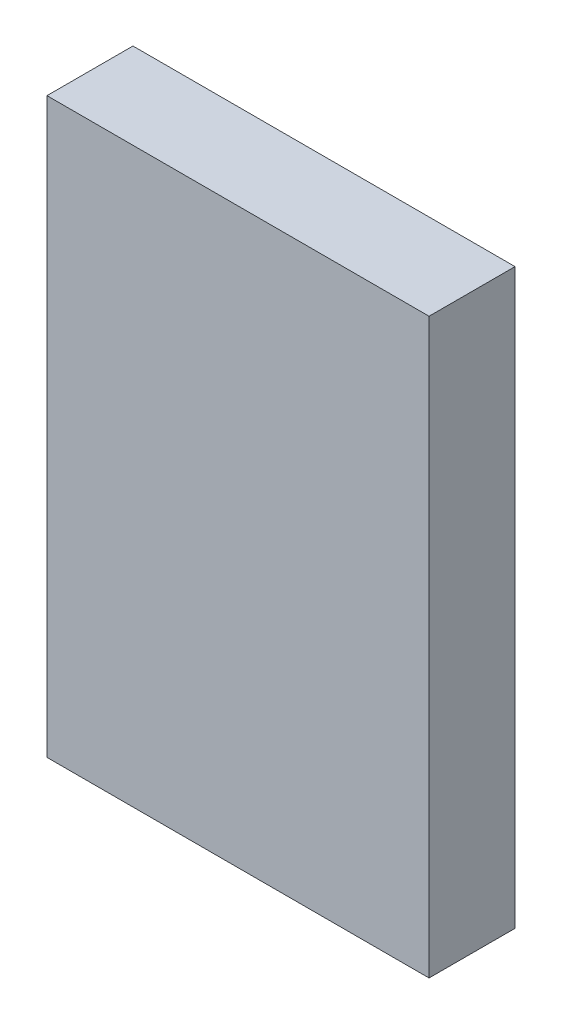
ISO-10303-21;
HEADER;
FILE_DESCRIPTION(('STEP AP214'),'2;1');
FILE_NAME('part.step','',(''),(''),'','','');
FILE_SCHEMA(('AUTOMOTIVE_DESIGN { 1 0 10303 214 1 1 1 1 }'));
ENDSEC;
DATA;
#1=APPLICATION_CONTEXT('core data for automotive mechanical design processes');
#2=APPLICATION_PROTOCOL_DEFINITION('international standard','automotive_design',2000,#1);
#3=PRODUCT_CONTEXT('',#1,'mechanical');
#4=PRODUCT('Part','Part','',(#3));
#5=PRODUCT_RELATED_PRODUCT_CATEGORY('part','',(#4));
#6=PRODUCT_DEFINITION_FORMATION('','',#4);
#7=PRODUCT_DEFINITION_CONTEXT('part definition',#1,'design');
#8=PRODUCT_DEFINITION('design','',#6,#7);
#9=PRODUCT_DEFINITION_SHAPE('','',#8);
#10=(LENGTH_UNIT() NAMED_UNIT(*) SI_UNIT(.MILLI.,.METRE.));
#11=(NAMED_UNIT(*) PLANE_ANGLE_UNIT() SI_UNIT($,.RADIAN.));
#12=(NAMED_UNIT(*) SI_UNIT($,.STERADIAN.) SOLID_ANGLE_UNIT());
#13=UNCERTAINTY_MEASURE_WITH_UNIT(LENGTH_MEASURE(1.E-05),#10,'distance_accuracy_value','');
#14=(GEOMETRIC_REPRESENTATION_CONTEXT(3) GLOBAL_UNCERTAINTY_ASSIGNED_CONTEXT((#13)) GLOBAL_UNIT_ASSIGNED_CONTEXT((#10,
#11,#12)) REPRESENTATION_CONTEXT('',''));
#15=CARTESIAN_POINT('',(0.,0.,0.));
#16=DIRECTION('',(0.,0.,1.));
#17=DIRECTION('',(1.,0.,0.));
#18=AXIS2_PLACEMENT_3D('',#15,#16,#17);
#19=CARTESIAN_POINT('',(40.,60.,18.));
#20=DIRECTION('',(-1.,0.,0.));
#21=DIRECTION('',(0.,0.,1.));
#22=AXIS2_PLACEMENT_3D('',#19,#20,#21);
#23=PLANE('',#22);
#24=DIRECTION('',(0.,1.,0.));
#25=VECTOR('',#24,1.);
#26=CARTESIAN_POINT('',(40.,60.,0.));
#27=LINE('',#26,#25);
#28=CARTESIAN_POINT('',(40.,-60.,0.));
#29=VERTEX_POINT('',#28);
#30=CARTESIAN_POINT('',(40.,60.,0.));
#31=VERTEX_POINT('',#30);
#32=EDGE_CURVE('E96',#29,#31,#27,.T.);
#33=ORIENTED_EDGE('',*,*,#32,.T.);
#34=DIRECTION('',(0.,0.,-1.));
#35=VECTOR('',#34,1.);
#36=CARTESIAN_POINT('',(40.,60.,18.));
#37=LINE('',#36,#35);
#38=CARTESIAN_POINT('',(40.,60.,18.));
#39=VERTEX_POINT('',#38);
#40=EDGE_CURVE('E11',#39,#31,#37,.T.);
#41=ORIENTED_EDGE('',*,*,#40,.F.);
#42=DIRECTION('',(0.,1.,0.));
#43=VECTOR('',#42,1.);
#44=CARTESIAN_POINT('',(40.,60.,18.));
#45=LINE('',#44,#43);
#46=CARTESIAN_POINT('',(40.,-60.,18.));
#47=VERTEX_POINT('',#46);
#48=EDGE_CURVE('E84',#47,#39,#45,.T.);
#49=ORIENTED_EDGE('',*,*,#48,.F.);
#50=DIRECTION('',(0.,0.,-1.));
#51=VECTOR('',#50,1.);
#52=CARTESIAN_POINT('',(40.,-60.,18.));
#53=LINE('',#52,#51);
#54=EDGE_CURVE('E92',#47,#29,#53,.T.);
#55=ORIENTED_EDGE('',*,*,#54,.T.);
#56=EDGE_LOOP('',(#33,#41,#49,#55));
#57=FACE_BOUND('',#56,.T.);
#58=ADVANCED_FACE('F33',(#57),#23,.F.);
#59=CARTESIAN_POINT('',(-40.,60.,18.));
#60=DIRECTION('',(0.,-1.,0.));
#61=DIRECTION('',(0.,0.,-1.));
#62=AXIS2_PLACEMENT_3D('',#59,#60,#61);
#63=PLANE('',#62);
#64=DIRECTION('',(-1.,0.,0.));
#65=VECTOR('',#64,1.);
#66=CARTESIAN_POINT('',(-40.,60.,0.));
#67=LINE('',#66,#65);
#68=CARTESIAN_POINT('',(-40.,60.,0.));
#69=VERTEX_POINT('',#68);
#70=EDGE_CURVE('E88',#31,#69,#67,.T.);
#71=ORIENTED_EDGE('',*,*,#70,.T.);
#72=DIRECTION('',(0.,0.,-1.));
#73=VECTOR('',#72,1.);
#74=CARTESIAN_POINT('',(-40.,60.,18.));
#75=LINE('',#74,#73);
#76=CARTESIAN_POINT('',(-40.,60.,18.));
#77=VERTEX_POINT('',#76);
#78=EDGE_CURVE('E41',#77,#69,#75,.T.);
#79=ORIENTED_EDGE('',*,*,#78,.F.);
#80=DIRECTION('',(-1.,0.,0.));
#81=VECTOR('',#80,1.);
#82=CARTESIAN_POINT('',(-40.,60.,18.));
#83=LINE('',#82,#81);
#84=EDGE_CURVE('E79',#39,#77,#83,.T.);
#85=ORIENTED_EDGE('',*,*,#84,.F.);
#86=ORIENTED_EDGE('',*,*,#40,.T.);
#87=EDGE_LOOP('',(#71,#79,#85,#86));
#88=FACE_BOUND('',#87,.T.);
#89=ADVANCED_FACE('F87',(#88),#63,.F.);
#90=CARTESIAN_POINT('',(-40.,60.,18.));
#91=DIRECTION('',(1.,0.,0.));
#92=DIRECTION('',(0.,1.,0.));
#93=AXIS2_PLACEMENT_3D('',#90,#91,#92);
#94=PLANE('',#93);
#95=DIRECTION('',(0.,-1.,0.));
#96=VECTOR('',#95,1.);
#97=CARTESIAN_POINT('',(-40.,60.,0.));
#98=LINE('',#97,#96);
#99=CARTESIAN_POINT('',(-40.,-60.,0.));
#100=VERTEX_POINT('',#99);
#101=EDGE_CURVE('E66',#69,#100,#98,.T.);
#102=ORIENTED_EDGE('',*,*,#101,.T.);
#103=DIRECTION('',(0.,0.,-1.));
#104=VECTOR('',#103,1.);
#105=CARTESIAN_POINT('',(-40.,-60.,18.));
#106=LINE('',#105,#104);
#107=CARTESIAN_POINT('',(-40.,-60.,18.));
#108=VERTEX_POINT('',#107);
#109=EDGE_CURVE('E89',#108,#100,#106,.T.);
#110=ORIENTED_EDGE('',*,*,#109,.F.);
#111=DIRECTION('',(0.,-1.,0.));
#112=VECTOR('',#111,1.);
#113=CARTESIAN_POINT('',(-40.,60.,18.));
#114=LINE('',#113,#112);
#115=EDGE_CURVE('E82',#77,#108,#114,.T.);
#116=ORIENTED_EDGE('',*,*,#115,.F.);
#117=ORIENTED_EDGE('',*,*,#78,.T.);
#118=EDGE_LOOP('',(#102,#110,#116,#117));
#119=FACE_BOUND('',#118,.T.);
#120=ADVANCED_FACE('F90',(#119),#94,.F.);
#121=CARTESIAN_POINT('',(-40.,-60.,18.));
#122=DIRECTION('',(0.,1.,0.));
#123=DIRECTION('',(0.,0.,1.));
#124=AXIS2_PLACEMENT_3D('',#121,#122,#123);
#125=PLANE('',#124);
#126=DIRECTION('',(1.,0.,0.));
#127=VECTOR('',#126,1.);
#128=CARTESIAN_POINT('',(-40.,-60.,0.));
#129=LINE('',#128,#127);
#130=EDGE_CURVE('E72',#100,#29,#129,.T.);
#131=ORIENTED_EDGE('',*,*,#130,.T.);
#132=ORIENTED_EDGE('',*,*,#54,.F.);
#133=DIRECTION('',(1.,0.,0.));
#134=VECTOR('',#133,1.);
#135=CARTESIAN_POINT('',(-40.,-60.,18.));
#136=LINE('',#135,#134);
#137=EDGE_CURVE('E49',#108,#47,#136,.T.);
#138=ORIENTED_EDGE('',*,*,#137,.F.);
#139=ORIENTED_EDGE('',*,*,#109,.T.);
#140=EDGE_LOOP('',(#131,#132,#138,#139));
#141=FACE_BOUND('',#140,.T.);
#142=ADVANCED_FACE('F103',(#141),#125,.F.);
#143=CARTESIAN_POINT('',(0.,0.,18.));
#144=DIRECTION('',(0.,0.,1.));
#145=DIRECTION('',(1.,0.,0.));
#146=AXIS2_PLACEMENT_3D('',#143,#144,#145);
#147=PLANE('',#146);
#148=ORIENTED_EDGE('',*,*,#48,.T.);
#149=ORIENTED_EDGE('',*,*,#84,.T.);
#150=ORIENTED_EDGE('',*,*,#115,.T.);
#151=ORIENTED_EDGE('',*,*,#137,.T.);
#152=EDGE_LOOP('',(#148,#149,#150,#151));
#153=FACE_BOUND('',#152,.T.);
#154=ADVANCED_FACE('F80',(#153),#147,.T.);
#155=CARTESIAN_POINT('',(0.,0.,0.));
#156=DIRECTION('',(0.,0.,1.));
#157=DIRECTION('',(1.,0.,0.));
#158=AXIS2_PLACEMENT_3D('',#155,#156,#157);
#159=PLANE('',#158);
#160=ORIENTED_EDGE('',*,*,#32,.F.);
#161=ORIENTED_EDGE('',*,*,#130,.F.);
#162=ORIENTED_EDGE('',*,*,#101,.F.);
#163=ORIENTED_EDGE('',*,*,#70,.F.);
#164=EDGE_LOOP('',(#160,#161,#162,#163));
#165=FACE_BOUND('',#164,.T.);
#166=ADVANCED_FACE('F106',(#165),#159,.F.);
#167=CLOSED_SHELL('',(#58,#89,#120,#142,#154,#166));
#168=MANIFOLD_SOLID_BREP('B2',#167);
#169=ADVANCED_BREP_SHAPE_REPRESENTATION('',(#18,#168),#14);
#170=SHAPE_DEFINITION_REPRESENTATION(#9,#169);
ENDSEC;
END-ISO-10303-21;
